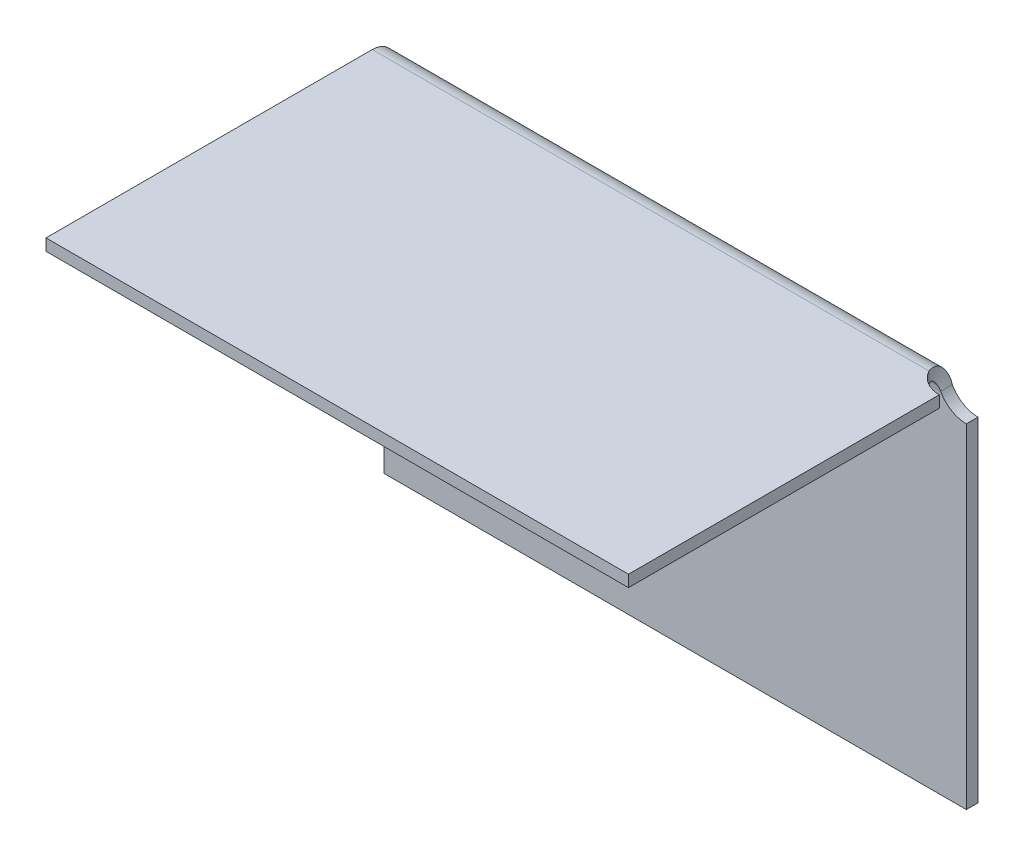
ISO-10303-21;
HEADER;
FILE_DESCRIPTION(('STEP AP214'),'2;1');
FILE_NAME('part.step','',(''),(''),'','','');
FILE_SCHEMA(('AUTOMOTIVE_DESIGN { 1 0 10303 214 1 1 1 1 }'));
ENDSEC;
DATA;
#1=APPLICATION_CONTEXT('core data for automotive mechanical design processes');
#2=APPLICATION_PROTOCOL_DEFINITION('international standard','automotive_design',2000,#1);
#3=PRODUCT_CONTEXT('',#1,'mechanical');
#4=PRODUCT('Part','Part','',(#3));
#5=PRODUCT_RELATED_PRODUCT_CATEGORY('part','',(#4));
#6=PRODUCT_DEFINITION_FORMATION('','',#4);
#7=PRODUCT_DEFINITION_CONTEXT('part definition',#1,'design');
#8=PRODUCT_DEFINITION('design','',#6,#7);
#9=PRODUCT_DEFINITION_SHAPE('','',#8);
#10=(LENGTH_UNIT() NAMED_UNIT(*) SI_UNIT(.MILLI.,.METRE.));
#11=(NAMED_UNIT(*) PLANE_ANGLE_UNIT() SI_UNIT($,.RADIAN.));
#12=(NAMED_UNIT(*) SI_UNIT($,.STERADIAN.) SOLID_ANGLE_UNIT());
#13=UNCERTAINTY_MEASURE_WITH_UNIT(LENGTH_MEASURE(1.E-05),#10,'distance_accuracy_value','');
#14=(GEOMETRIC_REPRESENTATION_CONTEXT(3) GLOBAL_UNCERTAINTY_ASSIGNED_CONTEXT((#13)) GLOBAL_UNIT_ASSIGNED_CONTEXT((#10,
#11,#12)) REPRESENTATION_CONTEXT('',''));
#15=CARTESIAN_POINT('',(0.,0.,0.));
#16=DIRECTION('',(0.,0.,1.));
#17=DIRECTION('',(1.,0.,0.));
#18=AXIS2_PLACEMENT_3D('',#15,#16,#17);
#19=CARTESIAN_POINT('',(50.,32.,0.));
#20=DIRECTION('',(-1.,0.,0.));
#21=DIRECTION('',(0.,0.,1.));
#22=AXIS2_PLACEMENT_3D('',#19,#20,#21);
#23=PLANE('',#22);
#24=DIRECTION('',(0.,-1.,0.));
#25=VECTOR('',#24,1.);
#26=CARTESIAN_POINT('',(50.,31.,2.32190275490382));
#27=LINE('',#26,#25);
#28=CARTESIAN_POINT('',(50.,31.,2.32190275490382));
#29=VERTEX_POINT('',#28);
#30=CARTESIAN_POINT('',(50.,32.,2.32190275490382));
#31=VERTEX_POINT('',#30);
#32=EDGE_CURVE('E159',#29,#31,#27,.F.);
#33=ORIENTED_EDGE('',*,*,#32,.T.);
#34=DIRECTION('',(0.,0.,-1.));
#35=VECTOR('',#34,1.);
#36=CARTESIAN_POINT('',(50.,32.,0.));
#37=LINE('',#36,#35);
#38=CARTESIAN_POINT('',(50.,32.0000000000001,29.));
#39=VERTEX_POINT('',#38);
#40=EDGE_CURVE('E158',#39,#31,#37,.T.);
#41=ORIENTED_EDGE('',*,*,#40,.F.);
#42=DIRECTION('',(0.,-1.,0.));
#43=VECTOR('',#42,1.);
#44=CARTESIAN_POINT('',(50.,32.0000000000001,29.));
#45=LINE('',#44,#43);
#46=CARTESIAN_POINT('',(50.,31.0000000000001,29.));
#47=VERTEX_POINT('',#46);
#48=EDGE_CURVE('E330',#39,#47,#45,.T.);
#49=ORIENTED_EDGE('',*,*,#48,.T.);
#50=DIRECTION('',(0.,0.,1.));
#51=VECTOR('',#50,1.);
#52=CARTESIAN_POINT('',(50.,31.,0.));
#53=LINE('',#52,#51);
#54=EDGE_CURVE('E321',#47,#29,#53,.F.);
#55=ORIENTED_EDGE('',*,*,#54,.T.);
#56=EDGE_LOOP('',(#33,#41,#49,#55));
#57=FACE_BOUND('',#56,.T.);
#58=ADVANCED_FACE('F63',(#57),#23,.F.);
#59=CARTESIAN_POINT('',(0.,32.,0.));
#60=DIRECTION('',(0.,-1.,0.));
#61=DIRECTION('',(0.,0.,-1.));
#62=AXIS2_PLACEMENT_3D('',#59,#60,#61);
#63=PLANE('',#62);
#64=CARTESIAN_POINT('',(50.,32.,-0.178097245096185));
#65=DIRECTION('',(0.,1.,0.));
#66=DIRECTION('',(-1.,0.,0.));
#67=AXIS2_PLACEMENT_3D('',#64,#65,#66);
#68=CIRCLE('',#67,2.5);
#69=CARTESIAN_POINT('',(47.7949859680499,32.,1.00000000000001));
#70=VERTEX_POINT('',#69);
#71=EDGE_CURVE('E144',#70,#31,#68,.T.);
#72=ORIENTED_EDGE('',*,*,#71,.F.);
#73=DIRECTION('',(1.,0.,0.));
#74=VECTOR('',#73,1.);
#75=CARTESIAN_POINT('',(50.,32.,1.00000000000001));
#76=LINE('',#75,#74);
#77=CARTESIAN_POINT('',(0.,32.,1.00000000000001));
#78=VERTEX_POINT('',#77);
#79=EDGE_CURVE('E150',#78,#70,#76,.T.);
#80=ORIENTED_EDGE('',*,*,#79,.F.);
#81=DIRECTION('',(0.,0.,1.));
#82=VECTOR('',#81,1.);
#83=CARTESIAN_POINT('',(0.,32.,0.));
#84=LINE('',#83,#82);
#85=CARTESIAN_POINT('',(0.,32.0000000000001,29.));
#86=VERTEX_POINT('',#85);
#87=EDGE_CURVE('E334',#78,#86,#84,.T.);
#88=ORIENTED_EDGE('',*,*,#87,.T.);
#89=DIRECTION('',(1.,0.,0.));
#90=VECTOR('',#89,1.);
#91=CARTESIAN_POINT('',(0.,32.0000000000001,29.));
#92=LINE('',#91,#90);
#93=EDGE_CURVE('E332',#86,#39,#92,.T.);
#94=ORIENTED_EDGE('',*,*,#93,.T.);
#95=ORIENTED_EDGE('',*,*,#40,.T.);
#96=EDGE_LOOP('',(#72,#80,#88,#94,#95));
#97=FACE_BOUND('',#96,.T.);
#98=ADVANCED_FACE('F155',(#97),#63,.F.);
#99=CARTESIAN_POINT('',(0.,31.,0.));
#100=DIRECTION('',(0.,-1.,0.));
#101=DIRECTION('',(0.,0.,-1.));
#102=AXIS2_PLACEMENT_3D('',#99,#100,#101);
#103=PLANE('',#102);
#104=DIRECTION('',(-1.,0.,0.));
#105=VECTOR('',#104,1.);
#106=CARTESIAN_POINT('',(50.,31.,1.00000000000001));
#107=LINE('',#106,#105);
#108=CARTESIAN_POINT('',(47.7949859680499,31.,1.00000000000001));
#109=VERTEX_POINT('',#108);
#110=CARTESIAN_POINT('',(0.,31.,1.00000000000001));
#111=VERTEX_POINT('',#110);
#112=EDGE_CURVE('E73',#109,#111,#107,.T.);
#113=ORIENTED_EDGE('',*,*,#112,.F.);
#114=CARTESIAN_POINT('',(50.,31.,-0.178097245096182));
#115=DIRECTION('',(0.,1.,0.));
#116=DIRECTION('',(-1.,0.,0.));
#117=AXIS2_PLACEMENT_3D('',#114,#115,#116);
#118=CIRCLE('',#117,2.5);
#119=EDGE_CURVE('E89',#109,#29,#118,.T.);
#120=ORIENTED_EDGE('',*,*,#119,.T.);
#121=ORIENTED_EDGE('',*,*,#54,.F.);
#122=DIRECTION('',(-1.,0.,0.));
#123=VECTOR('',#122,1.);
#124=CARTESIAN_POINT('',(50.,31.0000000000001,29.));
#125=LINE('',#124,#123);
#126=CARTESIAN_POINT('',(0.,31.0000000000001,29.));
#127=VERTEX_POINT('',#126);
#128=EDGE_CURVE('E337',#127,#47,#125,.F.);
#129=ORIENTED_EDGE('',*,*,#128,.F.);
#130=DIRECTION('',(0.,0.,-1.));
#131=VECTOR('',#130,1.);
#132=CARTESIAN_POINT('',(0.,31.0000000000001,29.));
#133=LINE('',#132,#131);
#134=EDGE_CURVE('E81',#111,#127,#133,.F.);
#135=ORIENTED_EDGE('',*,*,#134,.F.);
#136=EDGE_LOOP('',(#113,#120,#121,#129,#135));
#137=FACE_BOUND('',#136,.T.);
#138=ADVANCED_FACE('F304',(#137),#103,.T.);
#139=CARTESIAN_POINT('',(0.,32.0000000000001,29.));
#140=DIRECTION('',(1.,0.,0.));
#141=DIRECTION('',(0.,0.,-1.));
#142=AXIS2_PLACEMENT_3D('',#139,#140,#141);
#143=PLANE('',#142);
#144=DIRECTION('',(0.,1.,0.));
#145=VECTOR('',#144,1.);
#146=CARTESIAN_POINT('',(0.,31.,1.00000000000001));
#147=LINE('',#146,#145);
#148=EDGE_CURVE('E13',#111,#78,#147,.T.);
#149=ORIENTED_EDGE('',*,*,#148,.F.);
#150=ORIENTED_EDGE('',*,*,#134,.T.);
#151=DIRECTION('',(0.,-1.,0.));
#152=VECTOR('',#151,1.);
#153=CARTESIAN_POINT('',(0.,32.0000000000001,29.));
#154=LINE('',#153,#152);
#155=EDGE_CURVE('E170',#86,#127,#154,.T.);
#156=ORIENTED_EDGE('',*,*,#155,.F.);
#157=ORIENTED_EDGE('',*,*,#87,.F.);
#158=EDGE_LOOP('',(#149,#150,#156,#157));
#159=FACE_BOUND('',#158,.T.);
#160=ADVANCED_FACE('F307',(#159),#143,.F.);
#161=CARTESIAN_POINT('',(50.,32.0000000000001,29.));
#162=DIRECTION('',(0.,0.,-1.));
#163=DIRECTION('',(0.,1.,0.));
#164=AXIS2_PLACEMENT_3D('',#161,#162,#163);
#165=PLANE('',#164);
#166=ORIENTED_EDGE('',*,*,#128,.T.);
#167=ORIENTED_EDGE('',*,*,#48,.F.);
#168=ORIENTED_EDGE('',*,*,#93,.F.);
#169=ORIENTED_EDGE('',*,*,#155,.T.);
#170=EDGE_LOOP('',(#166,#167,#168,#169));
#171=FACE_BOUND('',#170,.T.);
#172=ADVANCED_FACE('F301',(#171),#165,.F.);
#173=CARTESIAN_POINT('',(50.,31.,-0.178097245096182));
#174=DIRECTION('',(0.,1.,0.));
#175=DIRECTION('',(-1.,0.,0.));
#176=AXIS2_PLACEMENT_3D('',#173,#174,#175);
#177=CYLINDRICAL_SURFACE('',#176,2.5);
#178=ORIENTED_EDGE('',*,*,#119,.F.);
#179=CARTESIAN_POINT('',(47.7949859680499,32.,1.00000000000001));
#180=CARTESIAN_POINT('',(47.7949859680499,31.,1.));
#181=B_SPLINE_CURVE_WITH_KNOTS('',1,(#179,#180),.UNSPECIFIED.,.F.,.F.,(2,2),(0.,1.),.UNSPECIFIED.);
#182=EDGE_CURVE('E141',#109,#70,#181,.F.);
#183=ORIENTED_EDGE('',*,*,#182,.T.);
#184=ORIENTED_EDGE('',*,*,#71,.T.);
#185=ORIENTED_EDGE('',*,*,#32,.F.);
#186=EDGE_LOOP('',(#178,#183,#184,#185));
#187=FACE_BOUND('',#186,.T.);
#188=ADVANCED_FACE('F143',(#187),#177,.F.);
#189=CARTESIAN_POINT('',(0.,0.,-1.));
#190=DIRECTION('',(0.,-1.,0.));
#191=DIRECTION('',(0.,0.,-1.));
#192=AXIS2_PLACEMENT_3D('',#189,#190,#191);
#193=PLANE('',#192);
#194=DIRECTION('',(1.,0.,0.));
#195=VECTOR('',#194,1.);
#196=CARTESIAN_POINT('',(0.,0.,0.));
#197=LINE('',#196,#195);
#198=CARTESIAN_POINT('',(0.,0.,0.));
#199=VERTEX_POINT('',#198);
#200=CARTESIAN_POINT('',(50.,0.,0.));
#201=VERTEX_POINT('',#200);
#202=EDGE_CURVE('E241',#199,#201,#197,.T.);
#203=ORIENTED_EDGE('',*,*,#202,.F.);
#204=DIRECTION('',(0.,0.,1.));
#205=VECTOR('',#204,1.);
#206=CARTESIAN_POINT('',(0.,0.,-1.));
#207=LINE('',#206,#205);
#208=CARTESIAN_POINT('',(0.,0.,-1.));
#209=VERTEX_POINT('',#208);
#210=EDGE_CURVE('E228',#209,#199,#207,.T.);
#211=ORIENTED_EDGE('',*,*,#210,.F.);
#212=DIRECTION('',(1.,0.,0.));
#213=VECTOR('',#212,1.);
#214=CARTESIAN_POINT('',(0.,0.,-1.));
#215=LINE('',#214,#213);
#216=CARTESIAN_POINT('',(50.,0.,-1.));
#217=VERTEX_POINT('',#216);
#218=EDGE_CURVE('E257',#209,#217,#215,.T.);
#219=ORIENTED_EDGE('',*,*,#218,.T.);
#220=DIRECTION('',(0.,0.,1.));
#221=VECTOR('',#220,1.);
#222=CARTESIAN_POINT('',(50.,0.,-1.));
#223=LINE('',#222,#221);
#224=EDGE_CURVE('E255',#217,#201,#223,.T.);
#225=ORIENTED_EDGE('',*,*,#224,.T.);
#226=EDGE_LOOP('',(#203,#211,#219,#225));
#227=FACE_BOUND('',#226,.T.);
#228=ADVANCED_FACE('F300',(#227),#193,.T.);
#229=CARTESIAN_POINT('',(50.,0.,-1.));
#230=DIRECTION('',(1.,0.,0.));
#231=DIRECTION('',(0.,0.,-1.));
#232=AXIS2_PLACEMENT_3D('',#229,#230,#231);
#233=PLANE('',#232);
#234=DIRECTION('',(0.,1.,0.));
#235=VECTOR('',#234,1.);
#236=CARTESIAN_POINT('',(50.,0.,-1.));
#237=LINE('',#236,#235);
#238=CARTESIAN_POINT('',(50.,28.6780972450962,-1.));
#239=VERTEX_POINT('',#238);
#240=EDGE_CURVE('E252',#217,#239,#237,.T.);
#241=ORIENTED_EDGE('',*,*,#240,.T.);
#242=DIRECTION('',(0.,0.,-1.));
#243=VECTOR('',#242,1.);
#244=CARTESIAN_POINT('',(50.,28.6780972450962,-1.));
#245=LINE('',#244,#243);
#246=CARTESIAN_POINT('',(50.,28.6780972450962,0.));
#247=VERTEX_POINT('',#246);
#248=EDGE_CURVE('E248',#239,#247,#245,.F.);
#249=ORIENTED_EDGE('',*,*,#248,.T.);
#250=DIRECTION('',(0.,1.,0.));
#251=VECTOR('',#250,1.);
#252=CARTESIAN_POINT('',(50.,0.,0.));
#253=LINE('',#252,#251);
#254=EDGE_CURVE('E238',#201,#247,#253,.T.);
#255=ORIENTED_EDGE('',*,*,#254,.F.);
#256=ORIENTED_EDGE('',*,*,#224,.F.);
#257=EDGE_LOOP('',(#241,#249,#255,#256));
#258=FACE_BOUND('',#257,.T.);
#259=ADVANCED_FACE('F397',(#258),#233,.T.);
#260=CARTESIAN_POINT('',(0.,0.,-1.));
#261=DIRECTION('',(0.,0.,-1.));
#262=DIRECTION('',(-1.,0.,0.));
#263=AXIS2_PLACEMENT_3D('',#260,#261,#262);
#264=PLANE('',#263);
#265=DIRECTION('',(-1.,0.,0.));
#266=VECTOR('',#265,1.);
#267=CARTESIAN_POINT('',(0.,30.,-1.));
#268=LINE('',#267,#266);
#269=CARTESIAN_POINT('',(47.7949859680499,30.,-1.));
#270=VERTEX_POINT('',#269);
#271=CARTESIAN_POINT('',(0.,30.,-1.));
#272=VERTEX_POINT('',#271);
#273=EDGE_CURVE('E262',#270,#272,#268,.T.);
#274=ORIENTED_EDGE('',*,*,#273,.F.);
#275=CARTESIAN_POINT('',(50.,31.1780972450962,-1.));
#276=DIRECTION('',(0.,0.,-1.));
#277=DIRECTION('',(-1.,0.,0.));
#278=AXIS2_PLACEMENT_3D('',#275,#276,#277);
#279=CIRCLE('',#278,2.5);
#280=EDGE_CURVE('E251',#239,#270,#279,.T.);
#281=ORIENTED_EDGE('',*,*,#280,.F.);
#282=ORIENTED_EDGE('',*,*,#240,.F.);
#283=ORIENTED_EDGE('',*,*,#218,.F.);
#284=DIRECTION('',(0.,-1.,0.));
#285=VECTOR('',#284,1.);
#286=CARTESIAN_POINT('',(0.,0.,-1.));
#287=LINE('',#286,#285);
#288=EDGE_CURVE('E235',#272,#209,#287,.T.);
#289=ORIENTED_EDGE('',*,*,#288,.F.);
#290=EDGE_LOOP('',(#274,#281,#282,#283,#289));
#291=FACE_BOUND('',#290,.T.);
#292=ADVANCED_FACE('F290',(#291),#264,.T.);
#293=CARTESIAN_POINT('',(50.,31.1780972450962,-1.));
#294=DIRECTION('',(0.,0.,-1.));
#295=DIRECTION('',(-1.,0.,0.));
#296=AXIS2_PLACEMENT_3D('',#293,#294,#295);
#297=CYLINDRICAL_SURFACE('',#296,2.5);
#298=ORIENTED_EDGE('',*,*,#280,.T.);
#299=CARTESIAN_POINT('',(47.7949859680499,30.,0.));
#300=CARTESIAN_POINT('',(47.7949859680499,30.,-1.));
#301=B_SPLINE_CURVE_WITH_KNOTS('',1,(#299,#300),.UNSPECIFIED.,.F.,.F.,(2,2),(0.,1.),.UNSPECIFIED.);
#302=CARTESIAN_POINT('',(47.7949859680499,30.,0.));
#303=VERTEX_POINT('',#302);
#304=EDGE_CURVE('E175',#270,#303,#301,.F.);
#305=ORIENTED_EDGE('',*,*,#304,.T.);
#306=CARTESIAN_POINT('',(50.,31.1780972450962,0.));
#307=DIRECTION('',(0.,0.,-1.));
#308=DIRECTION('',(-1.,0.,0.));
#309=AXIS2_PLACEMENT_3D('',#306,#307,#308);
#310=CIRCLE('',#309,2.5);
#311=EDGE_CURVE('E265',#247,#303,#310,.T.);
#312=ORIENTED_EDGE('',*,*,#311,.F.);
#313=ORIENTED_EDGE('',*,*,#248,.F.);
#314=EDGE_LOOP('',(#298,#305,#312,#313));
#315=FACE_BOUND('',#314,.T.);
#316=ADVANCED_FACE('F279',(#315),#297,.F.);
#317=CARTESIAN_POINT('',(0.,0.,0.));
#318=DIRECTION('',(0.,0.,-1.));
#319=DIRECTION('',(-1.,0.,0.));
#320=AXIS2_PLACEMENT_3D('',#317,#318,#319);
#321=PLANE('',#320);
#322=ORIENTED_EDGE('',*,*,#311,.T.);
#323=DIRECTION('',(-1.,0.,0.));
#324=VECTOR('',#323,1.);
#325=CARTESIAN_POINT('',(0.,30.,0.));
#326=LINE('',#325,#324);
#327=CARTESIAN_POINT('',(0.,30.,0.));
#328=VERTEX_POINT('',#327);
#329=EDGE_CURVE('E247',#303,#328,#326,.T.);
#330=ORIENTED_EDGE('',*,*,#329,.T.);
#331=DIRECTION('',(0.,-1.,0.));
#332=VECTOR('',#331,1.);
#333=CARTESIAN_POINT('',(0.,0.,0.));
#334=LINE('',#333,#332);
#335=EDGE_CURVE('E244',#328,#199,#334,.T.);
#336=ORIENTED_EDGE('',*,*,#335,.T.);
#337=ORIENTED_EDGE('',*,*,#202,.T.);
#338=ORIENTED_EDGE('',*,*,#254,.T.);
#339=EDGE_LOOP('',(#322,#330,#336,#337,#338));
#340=FACE_BOUND('',#339,.T.);
#341=ADVANCED_FACE('F289',(#340),#321,.F.);
#342=CARTESIAN_POINT('',(0.,0.,-1.));
#343=DIRECTION('',(-1.,0.,0.));
#344=DIRECTION('',(0.,0.,1.));
#345=AXIS2_PLACEMENT_3D('',#342,#343,#344);
#346=PLANE('',#345);
#347=ORIENTED_EDGE('',*,*,#335,.F.);
#348=DIRECTION('',(0.,0.,1.));
#349=VECTOR('',#348,1.);
#350=CARTESIAN_POINT('',(0.,30.,-1.));
#351=LINE('',#350,#349);
#352=EDGE_CURVE('E260',#272,#328,#351,.T.);
#353=ORIENTED_EDGE('',*,*,#352,.F.);
#354=ORIENTED_EDGE('',*,*,#288,.T.);
#355=ORIENTED_EDGE('',*,*,#210,.T.);
#356=EDGE_LOOP('',(#347,#353,#354,#355));
#357=FACE_BOUND('',#356,.T.);
#358=ADVANCED_FACE('F201',(#357),#346,.T.);
#359=CARTESIAN_POINT('',(47.7949859680499,32.,1.00000000000001));
#360=CARTESIAN_POINT('',(47.6920571753644,32.,0.703766688038661));
#361=CARTESIAN_POINT('',(47.6157990718201,31.9339991546606,0.42702889309256));
#362=CARTESIAN_POINT('',(47.54059493972,31.7743589245063,0.0678988456612664));
#363=CARTESIAN_POINT('',(47.5221031223613,31.7111100610461,-0.0426543938378792));
#364=CARTESIAN_POINT('',(47.5042297363353,31.606006975707,-0.193523376596028));
#365=CARTESIAN_POINT('',(47.499915997662,31.5692646412968,-0.241334446615156));
#366=CARTESIAN_POINT('',(47.4959114746551,31.5121532186437,-0.309300700389288));
#367=CARTESIAN_POINT('',(47.4949876478199,31.4927827585081,-0.331331826252035));
#368=CARTESIAN_POINT('',(47.494218428818,31.4632943369027,-0.363444491906915));
#369=CARTESIAN_POINT('',(47.4940647760257,31.4533927170996,-0.37399308592181));
#370=CARTESIAN_POINT('',(47.4939884271501,31.4384402513166,-0.389583207642548));
#371=CARTESIAN_POINT('',(47.4939886659104,31.4334394217899,-0.394741122501518));
#372=CARTESIAN_POINT('',(47.4940275566289,31.4259141744915,-0.402419912390249));
#373=CARTESIAN_POINT('',(47.4940469422981,31.4234017581225,-0.404969828771185));
#374=CARTESIAN_POINT('',(47.4940985578293,31.4183690910188,-0.410050320529804));
#375=CARTESIAN_POINT('',(47.4941382507016,31.415361484072,-0.413067640108175));
#376=CARTESIAN_POINT('',(47.4961655323132,31.2829741187678,-0.545288756082097));
#377=CARTESIAN_POINT('',(47.5222316226784,31.1061646485678,-0.686662111184277));
#378=CARTESIAN_POINT('',(47.6225037988119,30.6351613420596,-0.914418809090317));
#379=CARTESIAN_POINT('',(47.6963246632687,30.3402806120769,-1.));
#380=CARTESIAN_POINT('',(47.7949859680499,30.,-1.));
#381=CARTESIAN_POINT('',(47.7949859680499,31.,1.));
#382=CARTESIAN_POINT('',(47.6921018442757,31.,0.851947623504126));
#383=CARTESIAN_POINT('',(47.6157990718201,30.9669995773303,0.71351444654628));
#384=CARTESIAN_POINT('',(47.54059493972,30.8871794622531,0.533949422830634));
#385=CARTESIAN_POINT('',(47.5221031223613,30.8555550305231,0.478672803081061));
#386=CARTESIAN_POINT('',(47.5042297363353,30.8030034878535,0.403238311701986));
#387=CARTESIAN_POINT('',(47.499915997662,30.7846323206484,0.379332776692421));
#388=CARTESIAN_POINT('',(47.4959114746551,30.7560766093219,0.345349649805356));
#389=CARTESIAN_POINT('',(47.4949876478199,30.7463913792541,0.334334086873983));
#390=CARTESIAN_POINT('',(47.494218428818,30.7316471684513,0.318277754046543));
#391=CARTESIAN_POINT('',(47.4940647760257,30.7266963585498,0.313003457039095));
#392=CARTESIAN_POINT('',(47.4939884271501,30.7192201256583,0.305208396178726));
#393=CARTESIAN_POINT('',(47.4939886659104,30.716719710895,0.302629438749241));
#394=CARTESIAN_POINT('',(47.4940275566289,30.7129570872458,0.298790043804876));
#395=CARTESIAN_POINT('',(47.4940469422981,30.7117008790613,0.297515085614407));
#396=CARTESIAN_POINT('',(47.4940985578293,30.7091845455094,0.294974839735097));
#397=CARTESIAN_POINT('',(47.4941382507016,30.707680742036,0.293466179945912));
#398=CARTESIAN_POINT('',(47.4961655323132,30.6414870593839,0.227355621958952));
#399=CARTESIAN_POINT('',(47.5222316226784,30.5530823242839,0.156668944407862));
#400=CARTESIAN_POINT('',(47.6225037988119,30.3175806710298,0.0427905954548418));
#401=CARTESIAN_POINT('',(47.6963973673622,30.1700149286503,0.));
#402=CARTESIAN_POINT('',(47.7949859680499,30.,0.));
#403=B_SPLINE_SURFACE_WITH_KNOTS('',1,3,((#359,#360,#361,#362,#363,#364,#365,#366,#367,#368,
#369,#370,#371,#372,#373,#374,#375,#376,#377,#378,#379,#380),(#381,#382,#383,#384,#385,#386,
#387,#388,#389,#390,#391,#392,#393,#394,#395,#396,#397,#398,#399,#400,#401,#402)),.UNSPECIFIED.,
.F.,.F.,.F.,(2,2),(4,2,2,2,2,2,2,2,2,2,4),(0.,1.),(0.,0.25,0.375,0.4375,0.46875,0.484375,
0.4921875,0.49609375,0.5,0.75,1.),.UNSPECIFIED.);
#404=CARTESIAN_POINT('',(47.7949859680499,31.,1.));
#405=CARTESIAN_POINT('',(47.6921018442757,31.,0.851947623504126));
#406=CARTESIAN_POINT('',(47.6157990718201,30.9669995773303,0.71351444654628));
#407=CARTESIAN_POINT('',(47.54059493972,30.8871794622531,0.533949422830634));
#408=CARTESIAN_POINT('',(47.5221031223613,30.8555550305231,0.478672803081061));
#409=CARTESIAN_POINT('',(47.5042297363353,30.8030034878535,0.403238311701986));
#410=CARTESIAN_POINT('',(47.499915997662,30.7846323206484,0.379332776692421));
#411=CARTESIAN_POINT('',(47.4959114746551,30.7560766093219,0.345349649805356));
#412=CARTESIAN_POINT('',(47.4949876478199,30.7463913792541,0.334334086873983));
#413=CARTESIAN_POINT('',(47.494218428818,30.7316471684513,0.318277754046543));
#414=CARTESIAN_POINT('',(47.4940647760257,30.7266963585498,0.313003457039095));
#415=CARTESIAN_POINT('',(47.4939884271501,30.7192201256583,0.305208396178726));
#416=CARTESIAN_POINT('',(47.4939886659104,30.716719710895,0.302629438749241));
#417=CARTESIAN_POINT('',(47.4940275566289,30.7129570872458,0.298790043804876));
#418=CARTESIAN_POINT('',(47.4940469422981,30.7117008790613,0.297515085614407));
#419=CARTESIAN_POINT('',(47.4940985578293,30.7091845455094,0.294974839735097));
#420=CARTESIAN_POINT('',(47.4941382507016,30.707680742036,0.293466179945912));
#421=CARTESIAN_POINT('',(47.4961655323132,30.6414870593839,0.227355621958952));
#422=CARTESIAN_POINT('',(47.5222316226784,30.5530823242839,0.156668944407862));
#423=CARTESIAN_POINT('',(47.6225037988119,30.3175806710298,0.0427905954548418));
#424=CARTESIAN_POINT('',(47.6963973673622,30.1700149286503,0.));
#425=CARTESIAN_POINT('',(47.7949859680499,30.,0.));
#426=B_SPLINE_CURVE_WITH_KNOTS('',3,(#404,#405,#406,#407,#408,#409,#410,#411,#412,#413,#414,
#415,#416,#417,#418,#419,#420,#421,#422,#423,#424,#425),.UNSPECIFIED.,.F.,.F.,(4,2,2,2,2,2,2,2,
2,2,4),(0.,0.25,0.375,0.4375,0.46875,0.484375,0.4921875,0.49609375,0.5,0.75,1.),.UNSPECIFIED.);
#427=EDGE_CURVE('E354',#109,#303,#426,.T.);
#428=CARTESIAN_POINT('',(47.7949859680499,30.,-1.));
#429=CARTESIAN_POINT('',(47.6963246632687,30.3402806120769,-1.));
#430=CARTESIAN_POINT('',(47.6225037988119,30.6351613420596,-0.914418809090317));
#431=CARTESIAN_POINT('',(47.5222316226784,31.1061646485678,-0.686662111184277));
#432=CARTESIAN_POINT('',(47.4961655323132,31.2829741187678,-0.545288756082097));
#433=CARTESIAN_POINT('',(47.4941382507016,31.415361484072,-0.413067640108175));
#434=CARTESIAN_POINT('',(47.4940985578293,31.4183690910188,-0.410050320529804));
#435=CARTESIAN_POINT('',(47.4940469422981,31.4234017581225,-0.404969828771185));
#436=CARTESIAN_POINT('',(47.4940275566289,31.4259141744915,-0.402419912390249));
#437=CARTESIAN_POINT('',(47.4939886659104,31.4334394217899,-0.394741122501518));
#438=CARTESIAN_POINT('',(47.4939884271501,31.4384402513166,-0.389583207642548));
#439=CARTESIAN_POINT('',(47.4940647760257,31.4533927170996,-0.37399308592181));
#440=CARTESIAN_POINT('',(47.494218428818,31.4632943369027,-0.363444491906915));
#441=CARTESIAN_POINT('',(47.4949876478199,31.4927827585081,-0.331331826252035));
#442=CARTESIAN_POINT('',(47.4959114746551,31.5121532186437,-0.309300700389288));
#443=CARTESIAN_POINT('',(47.499915997662,31.5692646412968,-0.241334446615156));
#444=CARTESIAN_POINT('',(47.5042297363353,31.606006975707,-0.193523376596028));
#445=CARTESIAN_POINT('',(47.5221031223613,31.7111100610461,-0.0426543938378792));
#446=CARTESIAN_POINT('',(47.54059493972,31.7743589245063,0.0678988456612664));
#447=CARTESIAN_POINT('',(47.6157990718201,31.9339991546606,0.42702889309256));
#448=CARTESIAN_POINT('',(47.6920571753644,32.,0.703766688038661));
#449=CARTESIAN_POINT('',(47.7949859680499,32.,1.00000000000001));
#450=B_SPLINE_CURVE_WITH_KNOTS('',3,(#428,#429,#430,#431,#432,#433,#434,#435,#436,#437,#438,
#439,#440,#441,#442,#443,#444,#445,#446,#447,#448,#449),.UNSPECIFIED.,.F.,.F.,(4,2,2,2,2,2,2,2,
2,2,4),(0.,0.25,0.5,0.50390625,0.5078125,0.515625,0.53125,0.5625,0.625,0.75,1.),.UNSPECIFIED.);
#451=EDGE_CURVE('E165',#70,#270,#450,.F.);
#452=ORIENTED_EDGE('',*,*,#182,.F.);
#453=ORIENTED_EDGE('',*,*,#427,.T.);
#454=ORIENTED_EDGE('',*,*,#304,.F.);
#455=ORIENTED_EDGE('',*,*,#451,.F.);
#456=EDGE_LOOP('',(#452,#453,#454,#455));
#457=FACE_BOUND('',#456,.T.);
#458=ADVANCED_FACE('F173',(#457),#403,.T.);
#459=CARTESIAN_POINT('',(0.,30.,1.));
#460=DIRECTION('',(-1.,0.,0.));
#461=DIRECTION('',(0.,0.,1.));
#462=AXIS2_PLACEMENT_3D('',#459,#460,#461);
#463=PLANE('',#462);
#464=CARTESIAN_POINT('',(0.,30.,1.));
#465=DIRECTION('',(1.,0.,0.));
#466=DIRECTION('',(0.,0.,-1.));
#467=AXIS2_PLACEMENT_3D('',#464,#465,#466);
#468=CIRCLE('',#467,1.);
#469=EDGE_CURVE('E178',#328,#111,#468,.T.);
#470=ORIENTED_EDGE('',*,*,#469,.T.);
#471=ORIENTED_EDGE('',*,*,#148,.T.);
#472=CARTESIAN_POINT('',(0.,30.,1.));
#473=DIRECTION('',(1.,0.,0.));
#474=DIRECTION('',(0.,0.,-1.));
#475=AXIS2_PLACEMENT_3D('',#472,#473,#474);
#476=CIRCLE('',#475,2.);
#477=EDGE_CURVE('E169',#272,#78,#476,.T.);
#478=ORIENTED_EDGE('',*,*,#477,.F.);
#479=ORIENTED_EDGE('',*,*,#352,.T.);
#480=EDGE_LOOP('',(#470,#471,#478,#479));
#481=FACE_BOUND('',#480,.T.);
#482=ADVANCED_FACE('F200',(#481),#463,.T.);
#483=CARTESIAN_POINT('',(-23.965983030173,30.,1.));
#484=DIRECTION('',(1.,0.,0.));
#485=DIRECTION('',(0.,0.,-1.));
#486=AXIS2_PLACEMENT_3D('',#483,#484,#485);
#487=CYLINDRICAL_SURFACE('',#486,2.);
#488=ORIENTED_EDGE('',*,*,#273,.T.);
#489=ORIENTED_EDGE('',*,*,#477,.T.);
#490=ORIENTED_EDGE('',*,*,#79,.T.);
#491=ORIENTED_EDGE('',*,*,#451,.T.);
#492=EDGE_LOOP('',(#488,#489,#490,#491));
#493=FACE_BOUND('',#492,.T.);
#494=ADVANCED_FACE('F164',(#493),#487,.T.);
#495=CARTESIAN_POINT('',(-23.965983030173,30.,1.));
#496=DIRECTION('',(1.,0.,0.));
#497=DIRECTION('',(0.,0.,-1.));
#498=AXIS2_PLACEMENT_3D('',#495,#496,#497);
#499=CYLINDRICAL_SURFACE('',#498,1.);
#500=ORIENTED_EDGE('',*,*,#329,.F.);
#501=ORIENTED_EDGE('',*,*,#427,.F.);
#502=ORIENTED_EDGE('',*,*,#112,.T.);
#503=ORIENTED_EDGE('',*,*,#469,.F.);
#504=EDGE_LOOP('',(#500,#501,#502,#503));
#505=FACE_BOUND('',#504,.T.);
#506=ADVANCED_FACE('F202',(#505),#499,.F.);
#507=CLOSED_SHELL('',(#58,#98,#138,#160,#172,#188,#228,#259,#292,#316,#341,#358,#458,#482,#494,#506));
#508=MANIFOLD_SOLID_BREP('B2',#507);
#509=ADVANCED_BREP_SHAPE_REPRESENTATION('',(#18,#508),#14);
#510=SHAPE_DEFINITION_REPRESENTATION(#9,#509);
ENDSEC;
END-ISO-10303-21;
